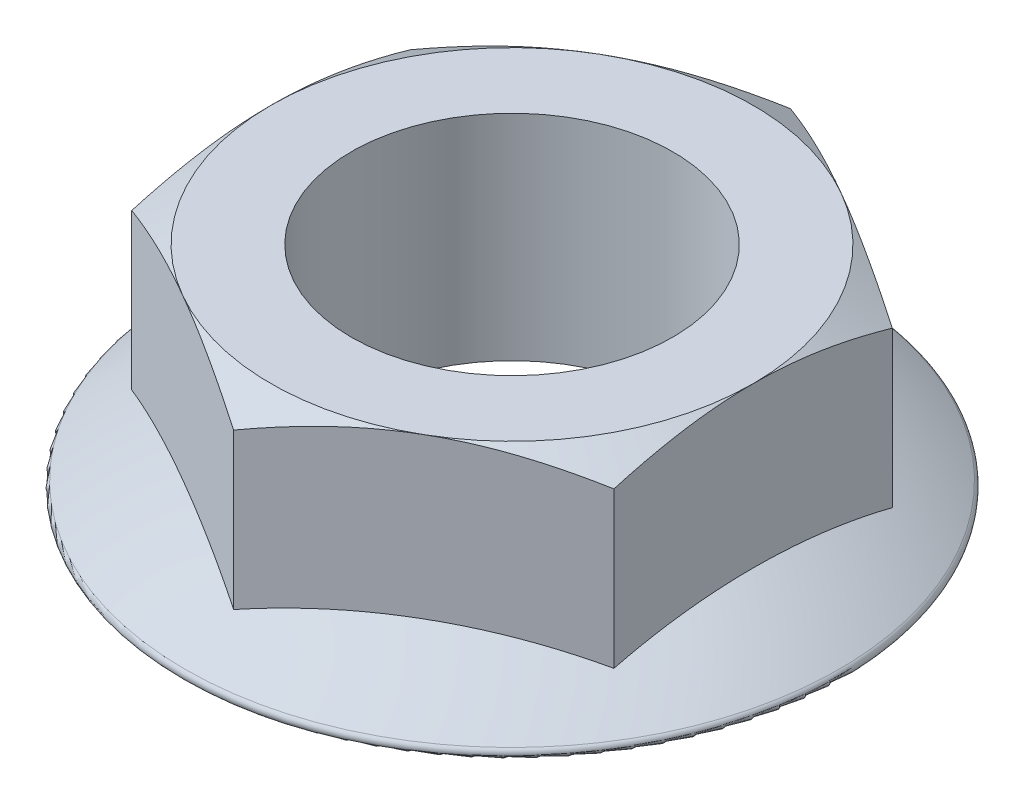
ISO-10303-21;
HEADER;
FILE_DESCRIPTION(('STEP AP214'),'2;1');
FILE_NAME('part.step','',(''),(''),'','','');
FILE_SCHEMA(('AUTOMOTIVE_DESIGN { 1 0 10303 214 1 1 1 1 }'));
ENDSEC;
DATA;
#1=APPLICATION_CONTEXT('core data for automotive mechanical design processes');
#2=APPLICATION_PROTOCOL_DEFINITION('international standard','automotive_design',2000,#1);
#3=PRODUCT_CONTEXT('',#1,'mechanical');
#4=PRODUCT('Part','Part','',(#3));
#5=PRODUCT_RELATED_PRODUCT_CATEGORY('part','',(#4));
#6=PRODUCT_DEFINITION_FORMATION('','',#4);
#7=PRODUCT_DEFINITION_CONTEXT('part definition',#1,'design');
#8=PRODUCT_DEFINITION('design','',#6,#7);
#9=PRODUCT_DEFINITION_SHAPE('','',#8);
#10=(LENGTH_UNIT() NAMED_UNIT(*) SI_UNIT(.MILLI.,.METRE.));
#11=(NAMED_UNIT(*) PLANE_ANGLE_UNIT() SI_UNIT($,.RADIAN.));
#12=(NAMED_UNIT(*) SI_UNIT($,.STERADIAN.) SOLID_ANGLE_UNIT());
#13=UNCERTAINTY_MEASURE_WITH_UNIT(LENGTH_MEASURE(1.E-05),#10,'distance_accuracy_value','');
#14=(GEOMETRIC_REPRESENTATION_CONTEXT(3) GLOBAL_UNCERTAINTY_ASSIGNED_CONTEXT((#13)) GLOBAL_UNIT_ASSIGNED_CONTEXT((#10,
#11,#12)) REPRESENTATION_CONTEXT('',''));
#15=CARTESIAN_POINT('',(0.,0.,0.));
#16=DIRECTION('',(0.,0.,1.));
#17=DIRECTION('',(1.,0.,0.));
#18=AXIS2_PLACEMENT_3D('',#15,#16,#17);
#19=CARTESIAN_POINT('',(0.,20.,0.));
#20=DIRECTION('',(0.,1.,0.));
#21=DIRECTION('',(0.,0.,1.));
#22=AXIS2_PLACEMENT_3D('',#19,#20,#21);
#23=PLANE('',#22);
#24=CARTESIAN_POINT('',(0.,20.,0.));
#25=DIRECTION('',(0.,1.,0.));
#26=DIRECTION('',(0.,0.,1.));
#27=AXIS2_PLACEMENT_3D('',#24,#25,#26);
#28=CIRCLE('',#27,15.);
#29=CARTESIAN_POINT('',(0.,20.,15.));
#30=VERTEX_POINT('',#29);
#31=EDGE_CURVE('E257',#30,#30,#28,.T.);
#32=ORIENTED_EDGE('',*,*,#31,.F.);
#33=EDGE_LOOP('',(#32));
#34=FACE_BOUND('',#33,.T.);
#35=CARTESIAN_POINT('',(0.,20.,0.));
#36=DIRECTION('',(0.,1.,0.));
#37=DIRECTION('',(0.,0.,1.));
#38=AXIS2_PLACEMENT_3D('',#35,#36,#37);
#39=CIRCLE('',#38,22.5000000000001);
#40=CARTESIAN_POINT('',(-11.25,20.,19.4855715851501));
#41=VERTEX_POINT('',#40);
#42=CARTESIAN_POINT('',(-22.5000000000001,20.,0.));
#43=VERTEX_POINT('',#42);
#44=EDGE_CURVE('E11',#41,#43,#39,.F.);
#45=ORIENTED_EDGE('',*,*,#44,.F.);
#46=CARTESIAN_POINT('',(11.2500000000002,20.,19.4855715851499));
#47=VERTEX_POINT('',#46);
#48=EDGE_CURVE('E41',#47,#41,#39,.F.);
#49=ORIENTED_EDGE('',*,*,#48,.F.);
#50=CARTESIAN_POINT('',(22.5000000000001,20.,-2.37365706600472E-13));
#51=VERTEX_POINT('',#50);
#52=EDGE_CURVE('E130',#51,#47,#39,.F.);
#53=ORIENTED_EDGE('',*,*,#52,.F.);
#54=CARTESIAN_POINT('',(0.,20.,0.));
#55=DIRECTION('',(0.,-1.,0.));
#56=DIRECTION('',(0.,0.,-1.));
#57=AXIS2_PLACEMENT_3D('',#54,#55,#56);
#58=CIRCLE('',#57,22.5000000000001);
#59=CARTESIAN_POINT('',(11.25,20.,-19.4855715851501));
#60=VERTEX_POINT('',#59);
#61=EDGE_CURVE('E282',#60,#51,#58,.T.);
#62=ORIENTED_EDGE('',*,*,#61,.F.);
#63=CARTESIAN_POINT('',(-11.2500000000001,20.,-19.48557158515));
#64=VERTEX_POINT('',#63);
#65=EDGE_CURVE('E286',#64,#60,#39,.F.);
#66=ORIENTED_EDGE('',*,*,#65,.F.);
#67=EDGE_CURVE('E46',#43,#64,#39,.F.);
#68=ORIENTED_EDGE('',*,*,#67,.F.);
#69=EDGE_LOOP('',(#45,#49,#53,#62,#66,#68));
#70=FACE_BOUND('',#69,.T.);
#71=ADVANCED_FACE('F37',(#34,#70),#23,.T.);
#72=CARTESIAN_POINT('',(22.4999999999999,20.,-12.9903810567668));
#73=DIRECTION('',(-0.499999999999995,0.,0.866025403784441));
#74=DIRECTION('',(0.866025403784441,0.,0.499999999999995));
#75=AXIS2_PLACEMENT_3D('',#72,#73,#74);
#76=PLANE('',#75);
#77=DIRECTION('',(0.,-1.,0.));
#78=VECTOR('',#77,1.);
#79=CARTESIAN_POINT('',(0.,20.,-25.9807621135332));
#80=LINE('',#79,#78);
#81=CARTESIAN_POINT('',(0.,17.9903810567667,-25.9807621135332));
#82=VERTEX_POINT('',#81);
#83=CARTESIAN_POINT('',(0.,3.48472082094103,-25.9807621135332));
#84=VERTEX_POINT('',#83);
#85=EDGE_CURVE('E233',#82,#84,#80,.T.);
#86=ORIENTED_EDGE('',*,*,#85,.F.);
#87=CARTESIAN_POINT('',(-0.0002,17.9903143896556,-25.980877583587));
#88=CARTESIAN_POINT('',(0.494340315320359,18.1551492707594,-25.6953545994117));
#89=CARTESIAN_POINT('',(0.990809601239482,18.3125041584607,-25.4087179235419));
#90=CARTESIAN_POINT('',(1.98772926208787,18.6101747825266,-24.8331460889907));
#91=CARTESIAN_POINT('',(2.4881808890523,18.7504849147613,-24.5442102074464));
#92=CARTESIAN_POINT('',(3.49404310444018,19.0121827394149,-23.9634753866245));
#93=CARTESIAN_POINT('',(3.99946257540049,19.1335252438812,-23.6716713190119));
#94=CARTESIAN_POINT('',(5.01379199131475,19.3546738156916,-23.0860479576869));
#95=CARTESIAN_POINT('',(5.52270158333679,19.4544820284597,-22.7922288677398));
#96=CARTESIAN_POINT('',(6.53100308542399,19.6283253044474,-22.2100857240854));
#97=CARTESIAN_POINT('',(7.03032020450332,19.7029352669186,-21.921804850974));
#98=CARTESIAN_POINT('',(8.03124235456728,19.8280391846674,-21.3439221781967));
#99=CARTESIAN_POINT('',(8.53284742940409,19.8785326757383,-21.0543203532128));
#100=CARTESIAN_POINT('',(9.53690018234175,19.954128715289,-20.4746302260236));
#101=CARTESIAN_POINT('',(10.0393461451645,19.9792614354898,-20.1845429141347));
#102=CARTESIAN_POINT('',(11.0447017408547,20.0035954599864,-19.6041005903317));
#103=CARTESIAN_POINT('',(11.5476113589139,20.0027975655861,-19.3137455869671));
#104=CARTESIAN_POINT('',(12.4878094832121,19.9770814657185,-18.770921946812));
#105=CARTESIAN_POINT('',(12.9251649504396,19.9552991118006,-18.5184146500767));
#106=CARTESIAN_POINT('',(13.7988317564138,19.892536574804,-18.0140028844654));
#107=CARTESIAN_POINT('',(14.2351431100254,19.8515566666916,-17.7620984070072));
#108=CARTESIAN_POINT('',(15.1065604849226,19.7511092481865,-17.2589853510338));
#109=CARTESIAN_POINT('',(15.5416650558498,19.6916250199366,-17.0077776098834));
#110=CARTESIAN_POINT('',(16.4097908378744,19.5552217340814,-16.506564955941));
#111=CARTESIAN_POINT('',(16.842812057791,19.4783027503465,-16.2565600380574));
#112=CARTESIAN_POINT('',(18.1573722886484,19.2194196562897,-15.4975983349059));
#113=CARTESIAN_POINT('',(19.0351763947765,19.0116278937021,-14.9907978979371));
#114=CARTESIAN_POINT('',(20.3421885092523,18.6578721503227,-14.2361941018104));
#115=CARTESIAN_POINT('',(20.7758690162323,18.5330695175296,-13.9858085443632));
#116=CARTESIAN_POINT('',(21.6402303188988,18.2708295210671,-13.4867693135916));
#117=CARTESIAN_POINT('',(22.070911923459,18.1333957185273,-13.2381151732638));
#118=CARTESIAN_POINT('',(22.5001999999999,17.9903143896556,-12.990265586713));
#119=B_SPLINE_CURVE_WITH_KNOTS('',3,(#87,#88,#89,#90,#91,#92,#93,#94,#95,#96,#97,#98,#99,#100,
#101,#102,#103,#104,#105,#106,#107,#108,#109,#110,#111,#112,#113,#114,#115,#116,#117,#118),
.UNSPECIFIED.,.F.,.F.,(4,2,2,2,2,2,2,2,2,2,2,2,2,2,2,4),(0.,1.78312722203929,3.56683913913433,
5.35473780165091,7.14245825659311,8.88609109738607,10.6297574992032,12.3713470058018,
14.1128826941264,15.6289689473497,17.1450334863601,18.6624717220613,20.1799035285481,
23.2816076138778,24.8297579454586,26.3774731352148),.UNSPECIFIED.);
#120=EDGE_CURVE('E138',#82,#60,#119,.T.);
#121=ORIENTED_EDGE('',*,*,#120,.T.);
#122=CARTESIAN_POINT('',(22.4999999999999,17.9903810567667,-12.9903810567668));
#123=VERTEX_POINT('',#122);
#124=EDGE_CURVE('E148',#60,#123,#119,.T.);
#125=ORIENTED_EDGE('',*,*,#124,.T.);
#126=DIRECTION('',(0.,-1.,0.));
#127=VECTOR('',#126,1.);
#128=CARTESIAN_POINT('',(22.4999999999999,20.,-12.9903810567668));
#129=LINE('',#128,#127);
#130=CARTESIAN_POINT('',(22.4999999999999,3.48472082094104,-12.9903810567668));
#131=VERTEX_POINT('',#130);
#132=EDGE_CURVE('E225',#123,#131,#129,.T.);
#133=ORIENTED_EDGE('',*,*,#132,.T.);
#134=CARTESIAN_POINT('',(11.2499999999999,-47.8745985610974,-19.48557158515));
#135=DIRECTION('',(-0.499999999999995,0.,0.866025403784441));
#136=DIRECTION('',(0.866025403784441,0.,0.499999999999995));
#137=AXIS2_PLACEMENT_3D('',#134,#135,#136);
#138=CIRCLE('',#137,52.9766900380367);
#139=EDGE_CURVE('E215',#131,#84,#138,.T.);
#140=ORIENTED_EDGE('',*,*,#139,.T.);
#141=EDGE_LOOP('',(#86,#121,#125,#133,#140));
#142=FACE_BOUND('',#141,.T.);
#143=ADVANCED_FACE('F202',(#142),#76,.F.);
#144=CARTESIAN_POINT('',(0.,20.,-25.9807621135332));
#145=DIRECTION('',(0.500000000000001,0.,0.866025403784438));
#146=DIRECTION('',(0.866025403784438,0.,-0.500000000000001));
#147=AXIS2_PLACEMENT_3D('',#144,#145,#146);
#148=PLANE('',#147);
#149=DIRECTION('',(0.,-1.,0.));
#150=VECTOR('',#149,1.);
#151=CARTESIAN_POINT('',(-22.5,20.,-12.9903810567665));
#152=LINE('',#151,#150);
#153=CARTESIAN_POINT('',(-22.5,17.9903810567667,-12.9903810567665));
#154=VERTEX_POINT('',#153);
#155=CARTESIAN_POINT('',(-22.5,3.48472082094103,-12.9903810567665));
#156=VERTEX_POINT('',#155);
#157=EDGE_CURVE('E237',#154,#156,#152,.T.);
#158=ORIENTED_EDGE('',*,*,#157,.F.);
#159=CARTESIAN_POINT('',(-22.5002,17.9903143896556,-12.9902655867127));
#160=CARTESIAN_POINT('',(-22.0056596846797,18.1551492707594,-13.275788570888));
#161=CARTESIAN_POINT('',(-21.5091903987606,18.3125041584607,-13.5624252467578));
#162=CARTESIAN_POINT('',(-20.5122707379122,18.6101747825266,-14.1379970813091));
#163=CARTESIAN_POINT('',(-20.0118191109478,18.7504849147613,-14.4269329628534));
#164=CARTESIAN_POINT('',(-19.0059568955599,19.0121827394149,-15.0076677836752));
#165=CARTESIAN_POINT('',(-18.5005374245996,19.1335252438813,-15.2994718512878));
#166=CARTESIAN_POINT('',(-17.4862080086853,19.3546738156916,-15.8850952126129));
#167=CARTESIAN_POINT('',(-16.9772984166633,19.4544820284598,-16.17891430256));
#168=CARTESIAN_POINT('',(-15.9689969145761,19.6283253044474,-16.7610574462143));
#169=CARTESIAN_POINT('',(-15.4696797954968,19.7029352669186,-17.0493383193258));
#170=CARTESIAN_POINT('',(-14.4687576454328,19.8280391846675,-17.6272209921031));
#171=CARTESIAN_POINT('',(-13.967152570596,19.8785326757384,-17.916822817087));
#172=CARTESIAN_POINT('',(-12.9630998176583,19.9541287152891,-18.4965129442761));
#173=CARTESIAN_POINT('',(-12.4606538548356,19.9792614354898,-18.7866002561651));
#174=CARTESIAN_POINT('',(-11.4552982591454,20.0035954599865,-19.3670425799681));
#175=CARTESIAN_POINT('',(-10.9523886410861,20.0027975655862,-19.6573975833327));
#176=CARTESIAN_POINT('',(-10.012190516788,19.9770814657186,-20.2002212234878));
#177=CARTESIAN_POINT('',(-9.57483504956047,19.9552991118007,-20.4527285202232));
#178=CARTESIAN_POINT('',(-8.70116824358623,19.8925365748041,-20.9571402858344));
#179=CARTESIAN_POINT('',(-8.26485688997461,19.8515566666917,-21.2090447632926));
#180=CARTESIAN_POINT('',(-7.3934395150774,19.7511092481865,-21.712157819266));
#181=CARTESIAN_POINT('',(-6.95833494415019,19.6916250199366,-21.9633655604165));
#182=CARTESIAN_POINT('',(-6.09020916212558,19.5552217340814,-22.4645782143588));
#183=CARTESIAN_POINT('',(-5.65718794220902,19.4783027503465,-22.7145831322425));
#184=CARTESIAN_POINT('',(-4.34262771135155,19.2194196562897,-23.473544835394));
#185=CARTESIAN_POINT('',(-3.46482360522344,19.0116278937021,-23.9803452723628));
#186=CARTESIAN_POINT('',(-2.15781149074761,18.6578721503227,-24.7349490684896));
#187=CARTESIAN_POINT('',(-1.7241309837676,18.5330695175296,-24.9853346259368));
#188=CARTESIAN_POINT('',(-0.859769681101072,18.2708295210672,-25.4843738567084));
#189=CARTESIAN_POINT('',(-0.429088076540885,18.1333957185273,-25.7330279970362));
#190=CARTESIAN_POINT('',(0.000199999999999464,17.9903143896556,-25.980877583587));
#191=B_SPLINE_CURVE_WITH_KNOTS('',3,(#159,#160,#161,#162,#163,#164,#165,#166,#167,#168,#169,
#170,#171,#172,#173,#174,#175,#176,#177,#178,#179,#180,#181,#182,#183,#184,#185,#186,#187,#188,
#189,#190),.UNSPECIFIED.,.F.,.F.,(4,2,2,2,2,2,2,2,2,2,2,2,2,2,2,4),(0.,1.78312722203929,
3.56683913913434,5.35473780165091,7.14245825659312,8.88609109738607,10.6297574992032,
12.3713470058018,14.1128826941264,15.6289689473497,17.1450334863602,18.6624717220614,
20.1799035285482,23.281607613878,24.8297579454588,26.3774731352151),.UNSPECIFIED.);
#192=EDGE_CURVE('E118',#154,#64,#191,.T.);
#193=ORIENTED_EDGE('',*,*,#192,.T.);
#194=EDGE_CURVE('E60',#64,#82,#191,.T.);
#195=ORIENTED_EDGE('',*,*,#194,.T.);
#196=ORIENTED_EDGE('',*,*,#85,.T.);
#197=CARTESIAN_POINT('',(-11.25,-47.8745985610974,-19.4855715851499));
#198=DIRECTION('',(0.500000000000001,0.,0.866025403784438));
#199=DIRECTION('',(0.866025403784438,0.,-0.500000000000001));
#200=AXIS2_PLACEMENT_3D('',#197,#198,#199);
#201=CIRCLE('',#200,52.9766900380368);
#202=EDGE_CURVE('E222',#84,#156,#201,.T.);
#203=ORIENTED_EDGE('',*,*,#202,.T.);
#204=EDGE_LOOP('',(#158,#193,#195,#196,#203));
#205=FACE_BOUND('',#204,.T.);
#206=ADVANCED_FACE('F266',(#205),#148,.F.);
#207=CARTESIAN_POINT('',(-22.5,20.,-12.9903810567665));
#208=DIRECTION('',(1.,0.,0.));
#209=DIRECTION('',(0.,0.,-1.));
#210=AXIS2_PLACEMENT_3D('',#207,#208,#209);
#211=PLANE('',#210);
#212=DIRECTION('',(0.,-1.,0.));
#213=VECTOR('',#212,1.);
#214=CARTESIAN_POINT('',(-22.5,20.,12.9903810567667));
#215=LINE('',#214,#213);
#216=CARTESIAN_POINT('',(-22.5,17.9903810567667,12.9903810567667));
#217=VERTEX_POINT('',#216);
#218=CARTESIAN_POINT('',(-22.5,3.48472082094104,12.9903810567667));
#219=VERTEX_POINT('',#218);
#220=EDGE_CURVE('E241',#217,#219,#215,.T.);
#221=ORIENTED_EDGE('',*,*,#220,.F.);
#222=CARTESIAN_POINT('',(-22.4999999999999,6.89447302354358,39.2012659009291));
#223=CARTESIAN_POINT('',(-22.4999999999999,7.1291437483998,38.7326063517069));
#224=CARTESIAN_POINT('',(-22.4999999999999,7.36298528568573,38.2635317742241));
#225=CARTESIAN_POINT('',(-22.4999999999999,7.82884484088591,37.3244754566161));
#226=CARTESIAN_POINT('',(-22.4999999999999,8.06086285050926,36.8544937123785));
#227=CARTESIAN_POINT('',(-22.4999999999999,8.75395933441702,35.4430201100813));
#228=CARTESIAN_POINT('',(-22.4999999999999,9.21205111587484,34.5000579924918));
#229=CARTESIAN_POINT('',(-22.4999999999999,10.1195219140132,32.6076206134377));
#230=CARTESIAN_POINT('',(-22.4999999999999,10.5688816436513,31.6581360899651));
#231=CARTESIAN_POINT('',(-22.4999999999999,11.4557984662582,29.7536822786458));
#232=CARTESIAN_POINT('',(-22.4999999999999,11.8933557888496,28.7987130979453));
#233=CARTESIAN_POINT('',(-22.4999999999999,12.7733931909627,26.8388984174317));
#234=CARTESIAN_POINT('',(-22.4999999999999,13.2152012977708,25.8337501106429));
#235=CARTESIAN_POINT('',(-22.4999999999999,14.078861229095,23.8148367246345));
#236=CARTESIAN_POINT('',(-22.4999999999999,14.5007121637488,22.801071263561));
#237=CARTESIAN_POINT('',(-22.4999999999999,15.3188053045396,20.7639013903352));
#238=CARTESIAN_POINT('',(-22.4999999999999,15.7150631993152,19.7405033324656));
#239=CARTESIAN_POINT('',(-22.4999999999999,16.2850462737361,18.19644551917));
#240=CARTESIAN_POINT('',(-22.4999999999999,16.4709682698331,17.6802813140634));
#241=CARTESIAN_POINT('',(-22.4999999999999,16.8335743048274,16.6447237121857));
#242=CARTESIAN_POINT('',(-22.4999999999999,17.0102585501514,16.1253303878631));
#243=CARTESIAN_POINT('',(-22.4999999999999,17.3930100017069,14.9620337792106));
#244=CARTESIAN_POINT('',(-22.5,17.5963686734074,14.3172344124533));
#245=CARTESIAN_POINT('',(-22.5,17.984610895767,13.022120668481));
#246=CARTESIAN_POINT('',(-22.5,18.1694957097502,12.3718066716848));
#247=CARTESIAN_POINT('',(-22.5,18.517899320842,11.0654300504598));
#248=CARTESIAN_POINT('',(-22.5,18.6814176073789,10.4093672890589));
#249=CARTESIAN_POINT('',(-22.5,18.9839373785542,9.09157736515438));
#250=CARTESIAN_POINT('',(-22.5,19.1229390007281,8.42985023444903));
#251=CARTESIAN_POINT('',(-22.5,19.3710856903724,7.1124250442812));
#252=CARTESIAN_POINT('',(-22.5,19.4806980343358,6.45681565540054));
#253=CARTESIAN_POINT('',(-22.5,19.6702538270544,5.14129429854003));
#254=CARTESIAN_POINT('',(-22.5,19.7501977719774,4.48138240270219));
#255=CARTESIAN_POINT('',(-22.5,19.8780163149672,3.15866752098919));
#256=CARTESIAN_POINT('',(-22.5,19.9259023467056,2.49586565082404));
#257=CARTESIAN_POINT('',(-22.5,19.9880937561756,1.16867671671524));
#258=CARTESIAN_POINT('',(-22.5,20.0023993596773,0.504289663459279));
#259=CARTESIAN_POINT('',(-22.5,19.9969265870006,-0.828469862735573));
#260=CARTESIAN_POINT('',(-22.5,19.9769360035557,-1.49684146438032));
#261=CARTESIAN_POINT('',(-22.5,19.903147326488,-2.83170319626998));
#262=CARTESIAN_POINT('',(-22.5,19.8493488577433,-3.49819330555602));
#263=CARTESIAN_POINT('',(-22.5,19.7096672644789,-4.82802937230631));
#264=CARTESIAN_POINT('',(-22.5,19.6237718001111,-5.49137402102605));
#265=CARTESIAN_POINT('',(-22.5,19.4224352567519,-6.81353428045401));
#266=CARTESIAN_POINT('',(-22.5,19.3069937129084,-7.47234981973772));
#267=CARTESIAN_POINT('',(-22.5,19.0473178311132,-8.79609915784135));
#268=CARTESIAN_POINT('',(-22.5,18.902619356582,-9.46094124076662));
#269=CARTESIAN_POINT('',(-22.5,18.5890092858376,-10.7848528361772));
#270=CARTESIAN_POINT('',(-22.5,18.4200975625288,-11.4439223183427));
#271=CARTESIAN_POINT('',(-22.5,18.0612404345635,-12.7562444082692));
#272=CARTESIAN_POINT('',(-22.5,17.8712960401261,-13.4094972937799));
#273=CARTESIAN_POINT('',(-22.5,17.473255291561,-14.7104641783254));
#274=CARTESIAN_POINT('',(-22.5,17.2651577554918,-15.3581778136834));
#275=CARTESIAN_POINT('',(-22.5000000000001,16.7069013463488,-17.0264936515868));
#276=CARTESIAN_POINT('',(-22.5000000000001,16.3449631883061,-18.043152917411));
#277=CARTESIAN_POINT('',(-22.5000000000001,15.590550301512,-20.0650727236199));
#278=CARTESIAN_POINT('',(-22.5000000000001,15.1980726455791,-21.0703321607355));
#279=CARTESIAN_POINT('',(-22.5000000000001,14.3889330191362,-23.0716719323576));
#280=CARTESIAN_POINT('',(-22.5000000000001,13.9722578648794,-24.0677469137911));
#281=CARTESIAN_POINT('',(-22.5000000000001,13.1199599740865,-26.0516767401568));
#282=CARTESIAN_POINT('',(-22.5000000000001,12.6843379849917,-27.0395319075276));
#283=CARTESIAN_POINT('',(-22.5000000000001,11.8168554631673,-28.9664014007347));
#284=CARTESIAN_POINT('',(-22.5000000000001,11.3856274225723,-29.905701314449));
#285=CARTESIAN_POINT('',(-22.5000000000001,10.5118557746831,-31.7790329399891));
#286=CARTESIAN_POINT('',(-22.5000000000001,10.0693119663586,-32.7130645578605));
#287=CARTESIAN_POINT('',(-22.5000000000001,9.17573901967877,-34.5749736426782));
#288=CARTESIAN_POINT('',(-22.5000000000001,8.72472669715079,-35.5028591907349));
#289=CARTESIAN_POINT('',(-22.5000000000001,8.04245282108956,-36.8918203683814));
#290=CARTESIAN_POINT('',(-22.5000000000001,7.81407562130581,-37.3543162966073));
#291=CARTESIAN_POINT('',(-22.5000000000001,7.35555768728425,-38.2784307862428));
#292=CARTESIAN_POINT('',(-22.5000000000001,7.12541696063692,-38.740049351418));
#293=CARTESIAN_POINT('',(-22.5000000000001,6.89447302354358,-39.2012659009289));
#294=B_SPLINE_CURVE_WITH_KNOTS('',3,(#222,#223,#224,#225,#226,#227,#228,#229,#230,#231,#232,
#233,#234,#235,#236,#237,#238,#239,#240,#241,#242,#243,#244,#245,#246,#247,#248,#249,#250,#251,
#252,#253,#254,#255,#256,#257,#258,#259,#260,#261,#262,#263,#264,#265,#266,#267,#268,#269,#270,
#271,#272,#273,#274,#275,#276,#277,#278,#279,#280,#281,#282,#283,#284,#285,#286,#287,#288,#289,
#290,#291,#292,#293),.UNSPECIFIED.,.F.,.F.,(4,2,2,2,2,2,2,2,2,2,2,2,2,2,2,2,2,2,2,2,2,2,2,2,2,2,
2,2,2,2,2,2,2,2,2,4),(0.,1.57238809791579,3.14478334076758,6.28976885250642,9.44105302667911,
12.5922758465328,15.885982536837,19.1798359507367,22.4716506699483,24.1174620164353,
25.7632365698799,27.7913162201474,29.819257086307,31.8472464030127,33.8752243425852,
35.868735813609,37.8622139440885,39.8549807077845,41.8477340735397,43.8528620927906,
45.8580123607161,47.8639343130008,49.8698878266465,51.9105905892238,53.9513040638737,
55.9919195636038,58.0326680260314,61.2694713568812,64.5065853153033,67.74547983608,
70.9842467000447,74.0848305099607,77.18546944163,80.2804938924524,81.8279170225351,
83.3753334960251),.UNSPECIFIED.);
#295=EDGE_CURVE('E114',#217,#43,#294,.T.);
#296=ORIENTED_EDGE('',*,*,#295,.T.);
#297=EDGE_CURVE('E53',#43,#154,#294,.T.);
#298=ORIENTED_EDGE('',*,*,#297,.T.);
#299=ORIENTED_EDGE('',*,*,#157,.T.);
#300=CARTESIAN_POINT('',(-22.5,-47.8745985610974,0.));
#301=DIRECTION('',(1.,0.,0.));
#302=DIRECTION('',(0.,0.,-1.));
#303=AXIS2_PLACEMENT_3D('',#300,#301,#302);
#304=CIRCLE('',#303,52.9766900380368);
#305=EDGE_CURVE('E247',#156,#219,#304,.T.);
#306=ORIENTED_EDGE('',*,*,#305,.T.);
#307=EDGE_LOOP('',(#221,#296,#298,#299,#306));
#308=FACE_BOUND('',#307,.T.);
#309=ADVANCED_FACE('F263',(#308),#211,.F.);
#310=CARTESIAN_POINT('',(-22.5,20.,12.9903810567667));
#311=DIRECTION('',(0.499999999999995,0.,-0.866025403784442));
#312=DIRECTION('',(-0.866025403784442,0.,-0.499999999999995));
#313=AXIS2_PLACEMENT_3D('',#310,#311,#312);
#314=PLANE('',#313);
#315=DIRECTION('',(0.,-1.,0.));
#316=VECTOR('',#315,1.);
#317=CARTESIAN_POINT('',(1.81422692176648E-13,20.,25.9807621135332));
#318=LINE('',#317,#316);
#319=CARTESIAN_POINT('',(1.81625231312379E-13,17.9903810567667,25.9807621135332));
#320=VERTEX_POINT('',#319);
#321=CARTESIAN_POINT('',(1.82145964977565E-13,3.48472082094103,25.9807621135332));
#322=VERTEX_POINT('',#321);
#323=EDGE_CURVE('E136',#320,#322,#318,.T.);
#324=ORIENTED_EDGE('',*,*,#323,.F.);
#325=CARTESIAN_POINT('',(0.000200000000181423,17.9903143896556,25.980877583587));
#326=CARTESIAN_POINT('',(-0.494340315320174,18.1551492707594,25.6953545994117));
#327=CARTESIAN_POINT('',(-0.990809601239295,18.3125041584607,25.4087179235419));
#328=CARTESIAN_POINT('',(-1.98772926208768,18.6101747825266,24.8331460889907));
#329=CARTESIAN_POINT('',(-2.48818088905211,18.7504849147613,24.5442102074464));
#330=CARTESIAN_POINT('',(-3.49404310444,19.0121827394149,23.9634753866245));
#331=CARTESIAN_POINT('',(-3.9994625754003,19.1335252438813,23.6716713190119));
#332=CARTESIAN_POINT('',(-5.01379199131457,19.3546738156916,23.0860479576869));
#333=CARTESIAN_POINT('',(-5.5227015833366,19.4544820284598,22.7922288677398));
#334=CARTESIAN_POINT('',(-6.5310030854238,19.6283253044474,22.2100857240854));
#335=CARTESIAN_POINT('',(-7.03032020450313,19.7029352669186,21.921804850974));
#336=CARTESIAN_POINT('',(-8.03124235456709,19.8280391846675,21.3439221781967));
#337=CARTESIAN_POINT('',(-8.53284742940391,19.8785326757384,21.0543203532128));
#338=CARTESIAN_POINT('',(-9.53690018234157,19.9541287152891,20.4746302260236));
#339=CARTESIAN_POINT('',(-10.0393461451643,19.9792614354898,20.1845429141347));
#340=CARTESIAN_POINT('',(-11.0447017408545,20.0035954599865,19.6041005903317));
#341=CARTESIAN_POINT('',(-11.5476113589138,20.0027975655862,19.3137455869671));
#342=CARTESIAN_POINT('',(-12.487809483212,19.9770814657186,18.770921946812));
#343=CARTESIAN_POINT('',(-12.9251649504394,19.9552991118007,18.5184146500766));
#344=CARTESIAN_POINT('',(-13.7988317564137,19.8925365748041,18.0140028844654));
#345=CARTESIAN_POINT('',(-14.2351431100253,19.8515566666917,17.7620984070072));
#346=CARTESIAN_POINT('',(-15.1065604849225,19.7511092481865,17.2589853510338));
#347=CARTESIAN_POINT('',(-15.5416650558497,19.6916250199366,17.0077776098833));
#348=CARTESIAN_POINT('',(-16.4097908378744,19.5552217340814,16.506564955941));
#349=CARTESIAN_POINT('',(-16.8428120577909,19.4783027503465,16.2565600380573));
#350=CARTESIAN_POINT('',(-18.1573722886484,19.2194196562897,15.4975983349058));
#351=CARTESIAN_POINT('',(-19.0351763947765,19.0116278937021,14.990797897937));
#352=CARTESIAN_POINT('',(-20.3421885092523,18.6578721503227,14.2361941018103));
#353=CARTESIAN_POINT('',(-20.7758690162323,18.5330695175296,13.9858085443631));
#354=CARTESIAN_POINT('',(-21.6402303188989,18.2708295210672,13.4867693135915));
#355=CARTESIAN_POINT('',(-22.0709119234591,18.1333957185273,13.2381151732636));
#356=CARTESIAN_POINT('',(-22.5002,17.9903143896556,12.9902655867129));
#357=B_SPLINE_CURVE_WITH_KNOTS('',3,(#325,#326,#327,#328,#329,#330,#331,#332,#333,#334,#335,
#336,#337,#338,#339,#340,#341,#342,#343,#344,#345,#346,#347,#348,#349,#350,#351,#352,#353,#354,
#355,#356),.UNSPECIFIED.,.F.,.F.,(4,2,2,2,2,2,2,2,2,2,2,2,2,2,2,4),(0.,1.78312722203929,
3.56683913913433,5.35473780165091,7.14245825659312,8.88609109738607,10.6297574992032,
12.3713470058018,14.1128826941264,15.6289689473497,17.1450334863602,18.6624717220614,
20.1799035285482,23.281607613878,24.8297579454589,26.3774731352151),.UNSPECIFIED.);
#358=EDGE_CURVE('E120',#320,#41,#357,.T.);
#359=ORIENTED_EDGE('',*,*,#358,.T.);
#360=EDGE_CURVE('E108',#41,#217,#357,.T.);
#361=ORIENTED_EDGE('',*,*,#360,.T.);
#362=ORIENTED_EDGE('',*,*,#220,.T.);
#363=CARTESIAN_POINT('',(-11.2499999999999,-47.8745985610974,19.4855715851499));
#364=DIRECTION('',(0.499999999999995,0.,-0.866025403784442));
#365=DIRECTION('',(-0.866025403784442,0.,-0.499999999999995));
#366=AXIS2_PLACEMENT_3D('',#363,#364,#365);
#367=CIRCLE('',#366,52.9766900380368);
#368=EDGE_CURVE('E250',#219,#322,#367,.T.);
#369=ORIENTED_EDGE('',*,*,#368,.T.);
#370=EDGE_LOOP('',(#324,#359,#361,#362,#369));
#371=FACE_BOUND('',#370,.T.);
#372=ADVANCED_FACE('F134',(#371),#314,.F.);
#373=CARTESIAN_POINT('',(1.81422692176648E-13,20.,25.9807621135332));
#374=DIRECTION('',(-0.500000000000007,0.,-0.866025403784435));
#375=DIRECTION('',(-0.866025403784435,0.,0.500000000000007));
#376=AXIS2_PLACEMENT_3D('',#373,#374,#375);
#377=PLANE('',#376);
#378=DIRECTION('',(0.,-1.,0.));
#379=VECTOR('',#378,1.);
#380=CARTESIAN_POINT('',(22.5000000000001,20.,12.9903810567664));
#381=LINE('',#380,#379);
#382=CARTESIAN_POINT('',(22.5000000000001,17.9903810567667,12.9903810567664));
#383=VERTEX_POINT('',#382);
#384=CARTESIAN_POINT('',(22.5000000000001,3.48472082094104,12.9903810567664));
#385=VERTEX_POINT('',#384);
#386=EDGE_CURVE('E231',#383,#385,#381,.T.);
#387=ORIENTED_EDGE('',*,*,#386,.F.);
#388=CARTESIAN_POINT('',(22.5002000000001,17.9903143896556,12.9902655867125));
#389=CARTESIAN_POINT('',(22.0056596846798,18.1551492707594,13.2757885708879));
#390=CARTESIAN_POINT('',(21.5091903987607,18.3125041584607,13.5624252467577));
#391=CARTESIAN_POINT('',(20.5122707379123,18.6101747825266,14.1379970813089));
#392=CARTESIAN_POINT('',(20.0118191109479,18.7504849147613,14.4269329628532));
#393=CARTESIAN_POINT('',(19.00595689556,19.0121827394149,15.0076677836751));
#394=CARTESIAN_POINT('',(18.5005374245997,19.1335252438813,15.2994718512877));
#395=CARTESIAN_POINT('',(17.4862080086854,19.3546738156916,15.8850952126128));
#396=CARTESIAN_POINT('',(16.9772984166634,19.4544820284598,16.1789143025599));
#397=CARTESIAN_POINT('',(15.9689969145762,19.6283253044474,16.7610574462142));
#398=CARTESIAN_POINT('',(15.4696797954969,19.7029352669186,17.0493383193257));
#399=CARTESIAN_POINT('',(14.4687576454329,19.8280391846675,17.627220992103));
#400=CARTESIAN_POINT('',(13.9671525705961,19.8785326757384,17.9168228170869));
#401=CARTESIAN_POINT('',(12.9630998176585,19.9541287152891,18.496512944276));
#402=CARTESIAN_POINT('',(12.4606538548357,19.9792614354898,18.786600256165));
#403=CARTESIAN_POINT('',(11.4552982591456,20.0035954599865,19.367042579968));
#404=CARTESIAN_POINT('',(10.9523886410863,20.0027975655862,19.6573975833326));
#405=CARTESIAN_POINT('',(10.0121905167881,19.9770814657186,20.2002212234877));
#406=CARTESIAN_POINT('',(9.57483504956062,19.9552991118007,20.4527285202231));
#407=CARTESIAN_POINT('',(8.70116824358637,19.8925365748041,20.9571402858344));
#408=CARTESIAN_POINT('',(8.26485688997476,19.8515566666917,21.2090447632925));
#409=CARTESIAN_POINT('',(7.39343951507754,19.7511092481865,21.712157819266));
#410=CARTESIAN_POINT('',(6.95833494415034,19.6916250199366,21.9633655604164));
#411=CARTESIAN_POINT('',(6.09020916212573,19.5552217340814,22.4645782143588));
#412=CARTESIAN_POINT('',(5.65718794220918,19.4783027503465,22.7145831322424));
#413=CARTESIAN_POINT('',(4.34262771135171,19.2194196562897,23.473544835394));
#414=CARTESIAN_POINT('',(3.46482360522361,19.0116278937021,23.9803452723628));
#415=CARTESIAN_POINT('',(2.15781149074778,18.6578721503227,24.7349490684896));
#416=CARTESIAN_POINT('',(1.72413098376778,18.5330695175296,24.9853346259368));
#417=CARTESIAN_POINT('',(0.85976968110125,18.2708295210672,25.4843738567084));
#418=CARTESIAN_POINT('',(0.429088076541064,18.1333957185273,25.7330279970362));
#419=CARTESIAN_POINT('',(-0.000199999999818623,17.9903143896556,25.980877583587));
#420=B_SPLINE_CURVE_WITH_KNOTS('',3,(#388,#389,#390,#391,#392,#393,#394,#395,#396,#397,#398,
#399,#400,#401,#402,#403,#404,#405,#406,#407,#408,#409,#410,#411,#412,#413,#414,#415,#416,#417,
#418,#419),.UNSPECIFIED.,.F.,.F.,(4,2,2,2,2,2,2,2,2,2,2,2,2,2,2,4),(0.,1.78312722203929,
3.56683913913433,5.35473780165091,7.14245825659311,8.88609109738607,10.6297574992032,
12.3713470058018,14.1128826941264,15.6289689473497,17.1450334863602,18.6624717220614,
20.1799035285482,23.281607613878,24.8297579454588,26.3774731352151),.UNSPECIFIED.);
#421=EDGE_CURVE('E140',#383,#47,#420,.T.);
#422=ORIENTED_EDGE('',*,*,#421,.T.);
#423=EDGE_CURVE('E126',#47,#320,#420,.T.);
#424=ORIENTED_EDGE('',*,*,#423,.T.);
#425=ORIENTED_EDGE('',*,*,#323,.T.);
#426=CARTESIAN_POINT('',(11.2500000000002,-47.8745985610974,19.4855715851498));
#427=DIRECTION('',(-0.500000000000007,0.,-0.866025403784435));
#428=DIRECTION('',(-0.866025403784435,0.,0.500000000000007));
#429=AXIS2_PLACEMENT_3D('',#426,#427,#428);
#430=CIRCLE('',#429,52.9766900380368);
#431=EDGE_CURVE('E252',#322,#385,#430,.T.);
#432=ORIENTED_EDGE('',*,*,#431,.T.);
#433=EDGE_LOOP('',(#387,#422,#424,#425,#432));
#434=FACE_BOUND('',#433,.T.);
#435=ADVANCED_FACE('F187',(#434),#377,.F.);
#436=CARTESIAN_POINT('',(22.5000000000001,20.,12.9903810567664));
#437=DIRECTION('',(-1.,0.,0.));
#438=DIRECTION('',(0.,0.,1.));
#439=AXIS2_PLACEMENT_3D('',#436,#437,#438);
#440=PLANE('',#439);
#441=ORIENTED_EDGE('',*,*,#132,.F.);
#442=CARTESIAN_POINT('',(22.4999999999996,6.89447302354358,-39.2012659009292));
#443=CARTESIAN_POINT('',(22.4999999999996,7.12914374839981,-38.732606351707));
#444=CARTESIAN_POINT('',(22.4999999999996,7.36298528568574,-38.2635317742242));
#445=CARTESIAN_POINT('',(22.4999999999996,7.82884484088592,-37.3244754566163));
#446=CARTESIAN_POINT('',(22.4999999999996,8.06086285050926,-36.8544937123786));
#447=CARTESIAN_POINT('',(22.4999999999996,8.75395933441701,-35.4430201100815));
#448=CARTESIAN_POINT('',(22.4999999999996,9.21205111587484,-34.500057992492));
#449=CARTESIAN_POINT('',(22.4999999999997,10.1195219140132,-32.6076206134378));
#450=CARTESIAN_POINT('',(22.4999999999997,10.5688816436513,-31.6581360899652));
#451=CARTESIAN_POINT('',(22.4999999999997,11.4557984662582,-29.7536822786459));
#452=CARTESIAN_POINT('',(22.4999999999997,11.8933557888496,-28.7987130979454));
#453=CARTESIAN_POINT('',(22.4999999999997,12.7733931909627,-26.8388984174318));
#454=CARTESIAN_POINT('',(22.4999999999997,13.2152012977708,-25.8337501106431));
#455=CARTESIAN_POINT('',(22.4999999999997,14.078861229095,-23.8148367246346));
#456=CARTESIAN_POINT('',(22.4999999999998,14.5007121637488,-22.8010712635611));
#457=CARTESIAN_POINT('',(22.4999999999998,15.3188053045396,-20.7639013903354));
#458=CARTESIAN_POINT('',(22.4999999999998,15.7150631993152,-19.7405033324658));
#459=CARTESIAN_POINT('',(22.4999999999998,16.2850462737361,-18.1964455191702));
#460=CARTESIAN_POINT('',(22.4999999999998,16.4709682698331,-17.6802813140635));
#461=CARTESIAN_POINT('',(22.4999999999998,16.8335743048274,-16.6447237121859));
#462=CARTESIAN_POINT('',(22.4999999999998,17.0102585501514,-16.1253303878632));
#463=CARTESIAN_POINT('',(22.4999999999998,17.3930100017069,-14.9620337792108));
#464=CARTESIAN_POINT('',(22.4999999999998,17.5963686734074,-14.3172344124534));
#465=CARTESIAN_POINT('',(22.4999999999999,17.984610895767,-13.0221206684811));
#466=CARTESIAN_POINT('',(22.4999999999999,18.1694957097502,-12.371806671685));
#467=CARTESIAN_POINT('',(22.4999999999999,18.517899320842,-11.06543005046));
#468=CARTESIAN_POINT('',(22.4999999999999,18.6814176073789,-10.4093672890591));
#469=CARTESIAN_POINT('',(22.4999999999999,18.9839373785542,-9.09157736515456));
#470=CARTESIAN_POINT('',(22.4999999999999,19.1229390007281,-8.4298502344492));
#471=CARTESIAN_POINT('',(22.4999999999999,19.3710856903724,-7.11242504428137));
#472=CARTESIAN_POINT('',(22.4999999999999,19.4806980343358,-6.45681565540071));
#473=CARTESIAN_POINT('',(22.4999999999999,19.6702538270544,-5.14129429854021));
#474=CARTESIAN_POINT('',(22.5,19.7501977719774,-4.48138240270236));
#475=CARTESIAN_POINT('',(22.5,19.8780163149672,-3.15866752098936));
#476=CARTESIAN_POINT('',(22.5,19.9259023467056,-2.49586565082421));
#477=CARTESIAN_POINT('',(22.5,19.9880937561756,-1.16867671671542));
#478=CARTESIAN_POINT('',(22.5,20.0023993596773,-0.504289663459452));
#479=CARTESIAN_POINT('',(22.5,19.9969265870006,0.8284698627354));
#480=CARTESIAN_POINT('',(22.5,19.9769360035557,1.49684146438014));
#481=CARTESIAN_POINT('',(22.5,19.903147326488,2.83170319626981));
#482=CARTESIAN_POINT('',(22.5,19.8493488577433,3.49819330555585));
#483=CARTESIAN_POINT('',(22.5,19.7096672644789,4.82802937230614));
#484=CARTESIAN_POINT('',(22.5000000000001,19.6237718001111,5.49137402102587));
#485=CARTESIAN_POINT('',(22.5000000000001,19.4224352567519,6.81353428045384));
#486=CARTESIAN_POINT('',(22.5000000000001,19.3069937129084,7.47234981973755));
#487=CARTESIAN_POINT('',(22.5000000000001,19.0473178311132,8.79609915784118));
#488=CARTESIAN_POINT('',(22.5000000000001,18.902619356582,9.46094124076644));
#489=CARTESIAN_POINT('',(22.5000000000001,18.5890092858376,10.784852836177));
#490=CARTESIAN_POINT('',(22.5000000000001,18.4200975625288,11.4439223183426));
#491=CARTESIAN_POINT('',(22.5000000000001,18.0612404345635,12.756244408269));
#492=CARTESIAN_POINT('',(22.5000000000001,17.8712960401261,13.4094972937797));
#493=CARTESIAN_POINT('',(22.5000000000002,17.473255291561,14.7104641783253));
#494=CARTESIAN_POINT('',(22.5000000000002,17.2651577554918,15.3581778136833));
#495=CARTESIAN_POINT('',(22.5000000000002,16.7069013463488,17.0264936515867));
#496=CARTESIAN_POINT('',(22.5000000000002,16.3449631883061,18.0431529174108));
#497=CARTESIAN_POINT('',(22.5000000000002,15.590550301512,20.0650727236197));
#498=CARTESIAN_POINT('',(22.5000000000002,15.1980726455791,21.0703321607353));
#499=CARTESIAN_POINT('',(22.5000000000002,14.3889330191362,23.0716719323574));
#500=CARTESIAN_POINT('',(22.5000000000003,13.9722578648794,24.0677469137909));
#501=CARTESIAN_POINT('',(22.5000000000003,13.1199599740865,26.0516767401566));
#502=CARTESIAN_POINT('',(22.5000000000003,12.6843379849917,27.0395319075275));
#503=CARTESIAN_POINT('',(22.5000000000003,11.8168554631673,28.9664014007345));
#504=CARTESIAN_POINT('',(22.5000000000003,11.3856274225723,29.9057013144489));
#505=CARTESIAN_POINT('',(22.5000000000003,10.5118557746831,31.7790329399889));
#506=CARTESIAN_POINT('',(22.5000000000003,10.0693119663586,32.7130645578604));
#507=CARTESIAN_POINT('',(22.5000000000004,9.17573901967877,34.5749736426781));
#508=CARTESIAN_POINT('',(22.5000000000004,8.7247266971508,35.5028591907347));
#509=CARTESIAN_POINT('',(22.5000000000004,8.04245282108957,36.8918203683812));
#510=CARTESIAN_POINT('',(22.5000000000004,7.81407562130581,37.3543162966071));
#511=CARTESIAN_POINT('',(22.5000000000004,7.35555768728425,38.2784307862426));
#512=CARTESIAN_POINT('',(22.5000000000004,7.12541696063692,38.7400493514178));
#513=CARTESIAN_POINT('',(22.5000000000004,6.89447302354359,39.2012659009287));
#514=B_SPLINE_CURVE_WITH_KNOTS('',3,(#442,#443,#444,#445,#446,#447,#448,#449,#450,#451,#452,
#453,#454,#455,#456,#457,#458,#459,#460,#461,#462,#463,#464,#465,#466,#467,#468,#469,#470,#471,
#472,#473,#474,#475,#476,#477,#478,#479,#480,#481,#482,#483,#484,#485,#486,#487,#488,#489,#490,
#491,#492,#493,#494,#495,#496,#497,#498,#499,#500,#501,#502,#503,#504,#505,#506,#507,#508,#509,
#510,#511,#512,#513),.UNSPECIFIED.,.F.,.F.,(4,2,2,2,2,2,2,2,2,2,2,2,2,2,2,2,2,2,2,2,2,2,2,2,2,2,
2,2,2,2,2,2,2,2,2,4),(0.,1.5723880979158,3.14478334076758,6.28976885250641,9.4410530266791,
12.5922758465328,15.885982536837,19.1798359507367,22.4716506699483,24.1174620164353,
25.7632365698799,27.7913162201474,29.819257086307,31.8472464030127,33.8752243425852,
35.868735813609,37.8622139440885,39.8549807077845,41.8477340735397,43.8528620927906,
45.8580123607161,47.8639343130008,49.8698878266465,51.9105905892238,53.9513040638737,
55.9919195636038,58.0326680260313,61.2694713568812,64.5065853153033,67.74547983608,
70.9842467000447,74.0848305099607,77.18546944163,80.2804938924524,81.8279170225351,
83.375333496025),.UNSPECIFIED.);
#515=EDGE_CURVE('E186',#123,#51,#514,.T.);
#516=ORIENTED_EDGE('',*,*,#515,.T.);
#517=EDGE_CURVE('E172',#51,#383,#514,.T.);
#518=ORIENTED_EDGE('',*,*,#517,.T.);
#519=ORIENTED_EDGE('',*,*,#386,.T.);
#520=CARTESIAN_POINT('',(22.5,-47.8745985610974,-2.37365706600471E-13));
#521=DIRECTION('',(-1.,0.,0.));
#522=DIRECTION('',(0.,0.,1.));
#523=AXIS2_PLACEMENT_3D('',#520,#521,#522);
#524=CIRCLE('',#523,52.9766900380368);
#525=EDGE_CURVE('E218',#385,#131,#524,.T.);
#526=ORIENTED_EDGE('',*,*,#525,.T.);
#527=EDGE_LOOP('',(#441,#516,#518,#519,#526));
#528=FACE_BOUND('',#527,.T.);
#529=ADVANCED_FACE('F190',(#528),#440,.F.);
#530=CARTESIAN_POINT('',(0.,-47.8745985610974,0.));
#531=DIRECTION('',(0.,-1.,0.));
#532=DIRECTION('',(0.,0.,-1.));
#533=AXIS2_PLACEMENT_3D('',#530,#531,#532);
#534=SPHERICAL_SURFACE('',#533,57.5567518835647);
#535=CARTESIAN_POINT('',(0.,0.923916512631281,0.));
#536=DIRECTION('',(0.,-1.,0.));
#537=DIRECTION('',(0.,0.,-1.));
#538=AXIS2_PLACEMENT_3D('',#535,#536,#537);
#539=CIRCLE('',#538,30.5202328625668);
#540=CARTESIAN_POINT('',(0.,0.923916512631281,-30.5202328625668));
#541=VERTEX_POINT('',#540);
#542=EDGE_CURVE('E131',#541,#541,#539,.F.);
#543=ORIENTED_EDGE('',*,*,#542,.T.);
#544=EDGE_LOOP('',(#543));
#545=FACE_BOUND('',#544,.T.);
#546=ORIENTED_EDGE('',*,*,#139,.F.);
#547=ORIENTED_EDGE('',*,*,#525,.F.);
#548=ORIENTED_EDGE('',*,*,#431,.F.);
#549=ORIENTED_EDGE('',*,*,#368,.F.);
#550=ORIENTED_EDGE('',*,*,#305,.F.);
#551=ORIENTED_EDGE('',*,*,#202,.F.);
#552=EDGE_LOOP('',(#546,#547,#548,#549,#550,#551));
#553=FACE_BOUND('',#552,.T.);
#554=ADVANCED_FACE('F195',(#545,#553),#534,.T.);
#555=CARTESIAN_POINT('',(0.,0.,0.));
#556=DIRECTION('',(0.,1.,0.));
#557=DIRECTION('',(0.,0.,1.));
#558=AXIS2_PLACEMENT_3D('',#555,#556,#557);
#559=PLANE('',#558);
#560=CARTESIAN_POINT('',(0.,0.,0.));
#561=DIRECTION('',(0.,1.,0.));
#562=DIRECTION('',(0.,0.,1.));
#563=AXIS2_PLACEMENT_3D('',#560,#561,#562);
#564=CIRCLE('',#563,15.);
#565=CARTESIAN_POINT('',(0.,0.,15.));
#566=VERTEX_POINT('',#565);
#567=EDGE_CURVE('E254',#566,#566,#564,.T.);
#568=ORIENTED_EDGE('',*,*,#567,.T.);
#569=EDGE_LOOP('',(#568));
#570=FACE_BOUND('',#569,.T.);
#571=CARTESIAN_POINT('',(0.,0.,0.));
#572=DIRECTION('',(0.,1.,0.));
#573=DIRECTION('',(0.,0.,1.));
#574=AXIS2_PLACEMENT_3D('',#571,#572,#573);
#575=CIRCLE('',#574,30.2551012154205);
#576=CARTESIAN_POINT('',(0.,0.,30.2551012154205));
#577=VERTEX_POINT('',#576);
#578=EDGE_CURVE('E232',#577,#577,#575,.F.);
#579=ORIENTED_EDGE('',*,*,#578,.T.);
#580=EDGE_LOOP('',(#579));
#581=FACE_BOUND('',#580,.T.);
#582=ADVANCED_FACE('F197',(#570,#581),#559,.F.);
#583=CARTESIAN_POINT('',(0.,0.5,0.));
#584=DIRECTION('',(0.,1.,0.));
#585=DIRECTION('',(0.,0.,1.));
#586=AXIS2_PLACEMENT_3D('',#583,#584,#585);
#587=TOROIDAL_SURFACE('',#586,30.2551012154205,0.5);
#588=ORIENTED_EDGE('',*,*,#542,.F.);
#589=EDGE_LOOP('',(#588));
#590=FACE_BOUND('',#589,.T.);
#591=ORIENTED_EDGE('',*,*,#578,.F.);
#592=EDGE_LOOP('',(#591));
#593=FACE_BOUND('',#592,.T.);
#594=ADVANCED_FACE('F39',(#590,#593),#587,.T.);
#595=CARTESIAN_POINT('',(0.,20.,0.));
#596=DIRECTION('',(0.,1.,0.));
#597=DIRECTION('',(0.,0.,1.));
#598=AXIS2_PLACEMENT_3D('',#595,#596,#597);
#599=CYLINDRICAL_SURFACE('',#598,15.);
#600=ORIENTED_EDGE('',*,*,#567,.F.);
#601=EDGE_LOOP('',(#600));
#602=FACE_BOUND('',#601,.T.);
#603=ORIENTED_EDGE('',*,*,#31,.T.);
#604=EDGE_LOOP('',(#603));
#605=FACE_BOUND('',#604,.T.);
#606=ADVANCED_FACE('F167',(#602,#605),#599,.F.);
#607=CARTESIAN_POINT('',(0.,20.,0.));
#608=DIRECTION('',(0.,-1.,0.));
#609=DIRECTION('',(0.,0.,-1.));
#610=AXIS2_PLACEMENT_3D('',#607,#608,#609);
#611=CONICAL_SURFACE('',#610,22.5000000000001,1.0471975511966);
#612=ORIENTED_EDGE('',*,*,#423,.F.);
#613=ORIENTED_EDGE('',*,*,#48,.T.);
#614=ORIENTED_EDGE('',*,*,#358,.F.);
#615=EDGE_LOOP('',(#612,#613,#614));
#616=FACE_BOUND('',#615,.T.);
#617=ADVANCED_FACE('F124',(#616),#611,.T.);
#618=ORIENTED_EDGE('',*,*,#517,.F.);
#619=ORIENTED_EDGE('',*,*,#52,.T.);
#620=ORIENTED_EDGE('',*,*,#421,.F.);
#621=EDGE_LOOP('',(#618,#619,#620));
#622=FACE_BOUND('',#621,.T.);
#623=ADVANCED_FACE('F166',(#622),#611,.T.);
#624=ORIENTED_EDGE('',*,*,#61,.T.);
#625=ORIENTED_EDGE('',*,*,#515,.F.);
#626=ORIENTED_EDGE('',*,*,#124,.F.);
#627=EDGE_LOOP('',(#624,#625,#626));
#628=FACE_BOUND('',#627,.T.);
#629=ADVANCED_FACE('F285',(#628),#611,.T.);
#630=ORIENTED_EDGE('',*,*,#65,.T.);
#631=ORIENTED_EDGE('',*,*,#120,.F.);
#632=ORIENTED_EDGE('',*,*,#194,.F.);
#633=EDGE_LOOP('',(#630,#631,#632));
#634=FACE_BOUND('',#633,.T.);
#635=ADVANCED_FACE('F287',(#634),#611,.T.);
#636=ORIENTED_EDGE('',*,*,#67,.T.);
#637=ORIENTED_EDGE('',*,*,#192,.F.);
#638=ORIENTED_EDGE('',*,*,#297,.F.);
#639=EDGE_LOOP('',(#636,#637,#638));
#640=FACE_BOUND('',#639,.T.);
#641=ADVANCED_FACE('F165',(#640),#611,.T.);
#642=ORIENTED_EDGE('',*,*,#360,.F.);
#643=ORIENTED_EDGE('',*,*,#44,.T.);
#644=ORIENTED_EDGE('',*,*,#295,.F.);
#645=EDGE_LOOP('',(#642,#643,#644));
#646=FACE_BOUND('',#645,.T.);
#647=ADVANCED_FACE('F110',(#646),#611,.T.);
#648=CLOSED_SHELL('',(#71,#143,#206,#309,#372,#435,#529,#554,#582,#594,#606,#617,#623,#629,#635,
#641,#647));
#649=MANIFOLD_SOLID_BREP('B2',#648);
#650=ADVANCED_BREP_SHAPE_REPRESENTATION('',(#18,#649),#14);
#651=SHAPE_DEFINITION_REPRESENTATION(#9,#650);
ENDSEC;
END-ISO-10303-21;
